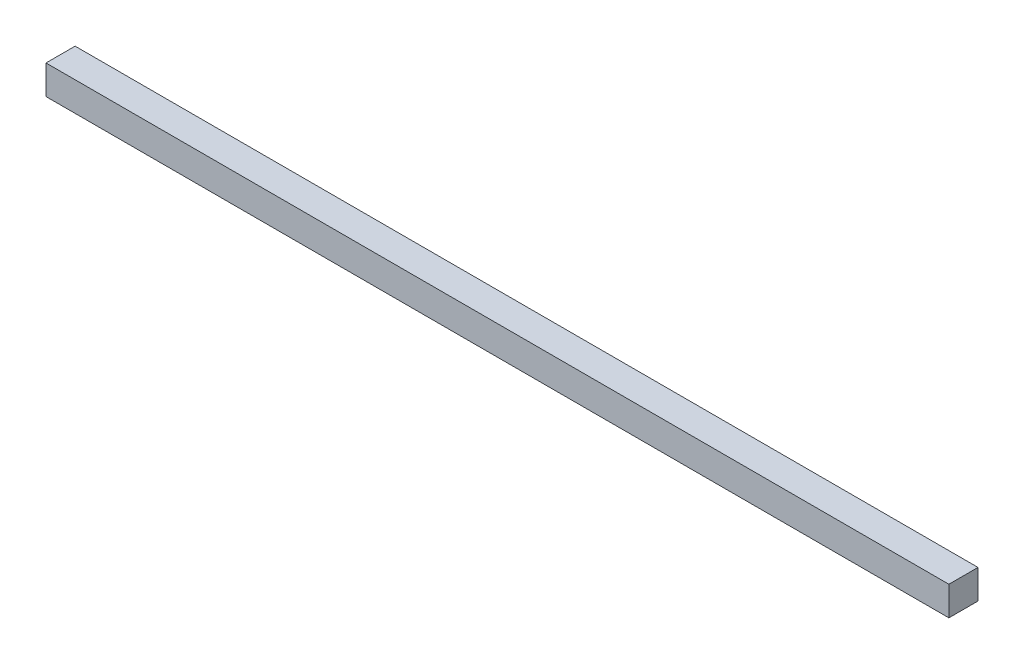
ISO-10303-21;
HEADER;
FILE_DESCRIPTION(('STEP AP214'),'2;1');
FILE_NAME('part.step','',(''),(''),'','','');
FILE_SCHEMA(('AUTOMOTIVE_DESIGN { 1 0 10303 214 1 1 1 1 }'));
ENDSEC;
DATA;
#1=APPLICATION_CONTEXT('core data for automotive mechanical design processes');
#2=APPLICATION_PROTOCOL_DEFINITION('international standard','automotive_design',2000,#1);
#3=PRODUCT_CONTEXT('',#1,'mechanical');
#4=PRODUCT('Part','Part','',(#3));
#5=PRODUCT_RELATED_PRODUCT_CATEGORY('part','',(#4));
#6=PRODUCT_DEFINITION_FORMATION('','',#4);
#7=PRODUCT_DEFINITION_CONTEXT('part definition',#1,'design');
#8=PRODUCT_DEFINITION('design','',#6,#7);
#9=PRODUCT_DEFINITION_SHAPE('','',#8);
#10=(LENGTH_UNIT() NAMED_UNIT(*) SI_UNIT(.MILLI.,.METRE.));
#11=(NAMED_UNIT(*) PLANE_ANGLE_UNIT() SI_UNIT($,.RADIAN.));
#12=(NAMED_UNIT(*) SI_UNIT($,.STERADIAN.) SOLID_ANGLE_UNIT());
#13=UNCERTAINTY_MEASURE_WITH_UNIT(LENGTH_MEASURE(1.E-05),#10,'distance_accuracy_value','');
#14=(GEOMETRIC_REPRESENTATION_CONTEXT(3) GLOBAL_UNCERTAINTY_ASSIGNED_CONTEXT((#13)) GLOBAL_UNIT_ASSIGNED_CONTEXT((#10,
#11,#12)) REPRESENTATION_CONTEXT('',''));
#15=CARTESIAN_POINT('',(0.,0.,0.));
#16=DIRECTION('',(0.,0.,1.));
#17=DIRECTION('',(1.,0.,0.));
#18=AXIS2_PLACEMENT_3D('',#15,#16,#17);
#19=CARTESIAN_POINT('',(-155.,10.,-4.99999999999999));
#20=DIRECTION('',(1.,0.,0.));
#21=DIRECTION('',(0.,0.,-1.));
#22=AXIS2_PLACEMENT_3D('',#19,#20,#21);
#23=PLANE('',#22);
#24=DIRECTION('',(0.,0.,1.));
#25=VECTOR('',#24,1.);
#26=CARTESIAN_POINT('',(-155.,0.,-4.99999999999999));
#27=LINE('',#26,#25);
#28=CARTESIAN_POINT('',(-155.,0.,-4.99999999999999));
#29=VERTEX_POINT('',#28);
#30=CARTESIAN_POINT('',(-155.,0.,5.00000000000001));
#31=VERTEX_POINT('',#30);
#32=EDGE_CURVE('E96',#29,#31,#27,.T.);
#33=ORIENTED_EDGE('',*,*,#32,.T.);
#34=DIRECTION('',(0.,-1.,0.));
#35=VECTOR('',#34,1.);
#36=CARTESIAN_POINT('',(-155.,10.,5.00000000000001));
#37=LINE('',#36,#35);
#38=CARTESIAN_POINT('',(-155.,10.,5.00000000000001));
#39=VERTEX_POINT('',#38);
#40=EDGE_CURVE('E11',#39,#31,#37,.T.);
#41=ORIENTED_EDGE('',*,*,#40,.F.);
#42=DIRECTION('',(0.,0.,1.));
#43=VECTOR('',#42,1.);
#44=CARTESIAN_POINT('',(-155.,10.,-4.99999999999999));
#45=LINE('',#44,#43);
#46=CARTESIAN_POINT('',(-155.,10.,-4.99999999999999));
#47=VERTEX_POINT('',#46);
#48=EDGE_CURVE('E84',#47,#39,#45,.T.);
#49=ORIENTED_EDGE('',*,*,#48,.F.);
#50=DIRECTION('',(0.,-1.,0.));
#51=VECTOR('',#50,1.);
#52=CARTESIAN_POINT('',(-155.,10.,-4.99999999999999));
#53=LINE('',#52,#51);
#54=EDGE_CURVE('E92',#47,#29,#53,.T.);
#55=ORIENTED_EDGE('',*,*,#54,.T.);
#56=EDGE_LOOP('',(#33,#41,#49,#55));
#57=FACE_BOUND('',#56,.T.);
#58=ADVANCED_FACE('F33',(#57),#23,.F.);
#59=CARTESIAN_POINT('',(-155.,10.,5.00000000000001));
#60=DIRECTION('',(0.,0.,-1.));
#61=DIRECTION('',(-1.,0.,0.));
#62=AXIS2_PLACEMENT_3D('',#59,#60,#61);
#63=PLANE('',#62);
#64=DIRECTION('',(1.,0.,0.));
#65=VECTOR('',#64,1.);
#66=CARTESIAN_POINT('',(-155.,0.,5.00000000000001));
#67=LINE('',#66,#65);
#68=CARTESIAN_POINT('',(155.,0.,5.00000000000001));
#69=VERTEX_POINT('',#68);
#70=EDGE_CURVE('E88',#31,#69,#67,.T.);
#71=ORIENTED_EDGE('',*,*,#70,.T.);
#72=DIRECTION('',(0.,-1.,0.));
#73=VECTOR('',#72,1.);
#74=CARTESIAN_POINT('',(155.,10.,5.00000000000001));
#75=LINE('',#74,#73);
#76=CARTESIAN_POINT('',(155.,10.,5.00000000000001));
#77=VERTEX_POINT('',#76);
#78=EDGE_CURVE('E41',#77,#69,#75,.T.);
#79=ORIENTED_EDGE('',*,*,#78,.F.);
#80=DIRECTION('',(1.,0.,0.));
#81=VECTOR('',#80,1.);
#82=CARTESIAN_POINT('',(-155.,10.,5.00000000000001));
#83=LINE('',#82,#81);
#84=EDGE_CURVE('E79',#39,#77,#83,.T.);
#85=ORIENTED_EDGE('',*,*,#84,.F.);
#86=ORIENTED_EDGE('',*,*,#40,.T.);
#87=EDGE_LOOP('',(#71,#79,#85,#86));
#88=FACE_BOUND('',#87,.T.);
#89=ADVANCED_FACE('F87',(#88),#63,.F.);
#90=CARTESIAN_POINT('',(155.,10.,-4.99999999999999));
#91=DIRECTION('',(-1.,0.,0.));
#92=DIRECTION('',(0.,0.,1.));
#93=AXIS2_PLACEMENT_3D('',#90,#91,#92);
#94=PLANE('',#93);
#95=DIRECTION('',(0.,0.,-1.));
#96=VECTOR('',#95,1.);
#97=CARTESIAN_POINT('',(155.,0.,-4.99999999999999));
#98=LINE('',#97,#96);
#99=CARTESIAN_POINT('',(155.,0.,-4.99999999999999));
#100=VERTEX_POINT('',#99);
#101=EDGE_CURVE('E66',#69,#100,#98,.T.);
#102=ORIENTED_EDGE('',*,*,#101,.T.);
#103=DIRECTION('',(0.,-1.,0.));
#104=VECTOR('',#103,1.);
#105=CARTESIAN_POINT('',(155.,10.,-4.99999999999999));
#106=LINE('',#105,#104);
#107=CARTESIAN_POINT('',(155.,10.,-4.99999999999999));
#108=VERTEX_POINT('',#107);
#109=EDGE_CURVE('E89',#108,#100,#106,.T.);
#110=ORIENTED_EDGE('',*,*,#109,.F.);
#111=DIRECTION('',(0.,0.,-1.));
#112=VECTOR('',#111,1.);
#113=CARTESIAN_POINT('',(155.,10.,-4.99999999999999));
#114=LINE('',#113,#112);
#115=EDGE_CURVE('E82',#77,#108,#114,.T.);
#116=ORIENTED_EDGE('',*,*,#115,.F.);
#117=ORIENTED_EDGE('',*,*,#78,.T.);
#118=EDGE_LOOP('',(#102,#110,#116,#117));
#119=FACE_BOUND('',#118,.T.);
#120=ADVANCED_FACE('F90',(#119),#94,.F.);
#121=CARTESIAN_POINT('',(-155.,10.,-4.99999999999999));
#122=DIRECTION('',(0.,0.,1.));
#123=DIRECTION('',(1.,0.,0.));
#124=AXIS2_PLACEMENT_3D('',#121,#122,#123);
#125=PLANE('',#124);
#126=DIRECTION('',(-1.,0.,0.));
#127=VECTOR('',#126,1.);
#128=CARTESIAN_POINT('',(-155.,0.,-4.99999999999999));
#129=LINE('',#128,#127);
#130=EDGE_CURVE('E72',#100,#29,#129,.T.);
#131=ORIENTED_EDGE('',*,*,#130,.T.);
#132=ORIENTED_EDGE('',*,*,#54,.F.);
#133=DIRECTION('',(-1.,0.,0.));
#134=VECTOR('',#133,1.);
#135=CARTESIAN_POINT('',(-155.,10.,-4.99999999999999));
#136=LINE('',#135,#134);
#137=EDGE_CURVE('E49',#108,#47,#136,.T.);
#138=ORIENTED_EDGE('',*,*,#137,.F.);
#139=ORIENTED_EDGE('',*,*,#109,.T.);
#140=EDGE_LOOP('',(#131,#132,#138,#139));
#141=FACE_BOUND('',#140,.T.);
#142=ADVANCED_FACE('F103',(#141),#125,.F.);
#143=CARTESIAN_POINT('',(0.,10.,0.));
#144=DIRECTION('',(0.,1.,0.));
#145=DIRECTION('',(0.,0.,1.));
#146=AXIS2_PLACEMENT_3D('',#143,#144,#145);
#147=PLANE('',#146);
#148=ORIENTED_EDGE('',*,*,#48,.T.);
#149=ORIENTED_EDGE('',*,*,#84,.T.);
#150=ORIENTED_EDGE('',*,*,#115,.T.);
#151=ORIENTED_EDGE('',*,*,#137,.T.);
#152=EDGE_LOOP('',(#148,#149,#150,#151));
#153=FACE_BOUND('',#152,.T.);
#154=ADVANCED_FACE('F80',(#153),#147,.T.);
#155=CARTESIAN_POINT('',(0.,0.,0.));
#156=DIRECTION('',(0.,1.,0.));
#157=DIRECTION('',(0.,0.,1.));
#158=AXIS2_PLACEMENT_3D('',#155,#156,#157);
#159=PLANE('',#158);
#160=ORIENTED_EDGE('',*,*,#32,.F.);
#161=ORIENTED_EDGE('',*,*,#130,.F.);
#162=ORIENTED_EDGE('',*,*,#101,.F.);
#163=ORIENTED_EDGE('',*,*,#70,.F.);
#164=EDGE_LOOP('',(#160,#161,#162,#163));
#165=FACE_BOUND('',#164,.T.);
#166=ADVANCED_FACE('F106',(#165),#159,.F.);
#167=CLOSED_SHELL('',(#58,#89,#120,#142,#154,#166));
#168=MANIFOLD_SOLID_BREP('B2',#167);
#169=ADVANCED_BREP_SHAPE_REPRESENTATION('',(#18,#168),#14);
#170=SHAPE_DEFINITION_REPRESENTATION(#9,#169);
ENDSEC;
END-ISO-10303-21;
